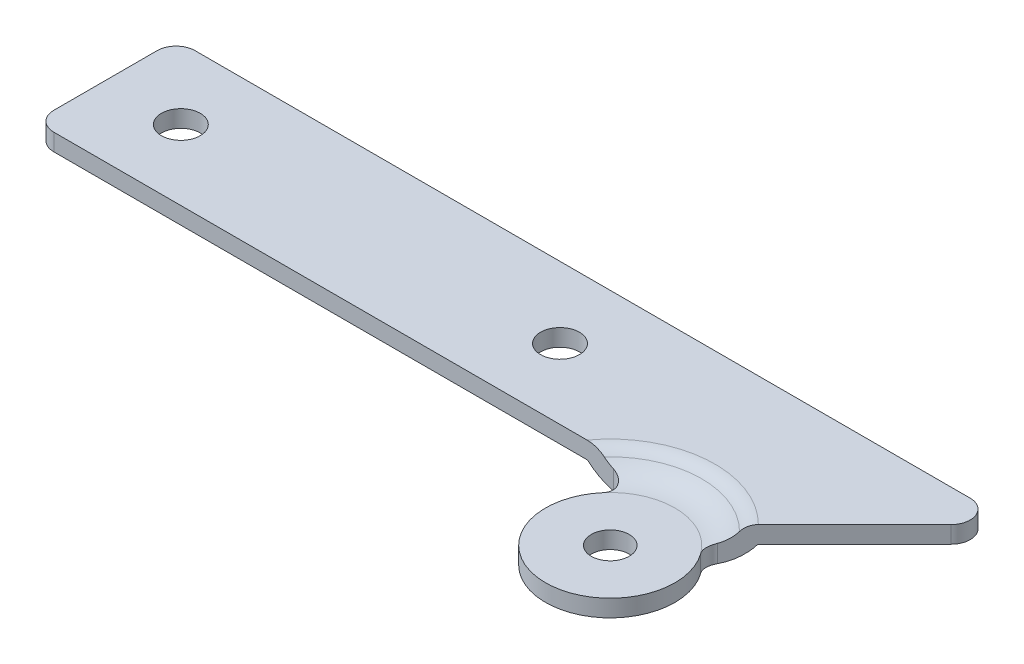
ISO-10303-21;
HEADER;
FILE_DESCRIPTION(('STEP AP214'),'2;1');
FILE_NAME('part.step','',(''),(''),'','','');
FILE_SCHEMA(('AUTOMOTIVE_DESIGN { 1 0 10303 214 1 1 1 1 }'));
ENDSEC;
DATA;
#1=APPLICATION_CONTEXT('core data for automotive mechanical design processes');
#2=APPLICATION_PROTOCOL_DEFINITION('international standard','automotive_design',2000,#1);
#3=PRODUCT_CONTEXT('',#1,'mechanical');
#4=PRODUCT('Part','Part','',(#3));
#5=PRODUCT_RELATED_PRODUCT_CATEGORY('part','',(#4));
#6=PRODUCT_DEFINITION_FORMATION('','',#4);
#7=PRODUCT_DEFINITION_CONTEXT('part definition',#1,'design');
#8=PRODUCT_DEFINITION('design','',#6,#7);
#9=PRODUCT_DEFINITION_SHAPE('','',#8);
#10=(LENGTH_UNIT() NAMED_UNIT(*) SI_UNIT(.MILLI.,.METRE.));
#11=(NAMED_UNIT(*) PLANE_ANGLE_UNIT() SI_UNIT($,.RADIAN.));
#12=(NAMED_UNIT(*) SI_UNIT($,.STERADIAN.) SOLID_ANGLE_UNIT());
#13=UNCERTAINTY_MEASURE_WITH_UNIT(LENGTH_MEASURE(1.E-05),#10,'distance_accuracy_value','');
#14=(GEOMETRIC_REPRESENTATION_CONTEXT(3) GLOBAL_UNCERTAINTY_ASSIGNED_CONTEXT((#13)) GLOBAL_UNIT_ASSIGNED_CONTEXT((#10,
#11,#12)) REPRESENTATION_CONTEXT('',''));
#15=CARTESIAN_POINT('',(0.,0.,0.));
#16=DIRECTION('',(0.,0.,1.));
#17=DIRECTION('',(1.,0.,0.));
#18=AXIS2_PLACEMENT_3D('',#15,#16,#17);
#19=CARTESIAN_POINT('',(44.4503952922486,-3.13962266922809,17.653));
#20=DIRECTION('',(0.,1.,0.));
#21=DIRECTION('',(0.,0.,1.));
#22=AXIS2_PLACEMENT_3D('',#19,#20,#21);
#23=CYLINDRICAL_SURFACE('',#22,2.54);
#24=CARTESIAN_POINT('',(44.4503952922486,-0.12700000003041,17.653));
#25=DIRECTION('',(0.,1.,0.));
#26=DIRECTION('',(0.,0.,1.));
#27=AXIS2_PLACEMENT_3D('',#24,#25,#26);
#28=CIRCLE('',#27,2.54);
#29=CARTESIAN_POINT('',(44.4503952922486,-0.12700000003041,20.193));
#30=VERTEX_POINT('',#29);
#31=EDGE_CURVE('E19',#30,#30,#28,.T.);
#32=ORIENTED_EDGE('',*,*,#31,.T.);
#33=EDGE_LOOP('',(#32));
#34=FACE_BOUND('',#33,.T.);
#35=CARTESIAN_POINT('',(44.4503952922486,-2.41300000003041,17.653));
#36=DIRECTION('',(0.,1.,0.));
#37=DIRECTION('',(0.,0.,1.));
#38=AXIS2_PLACEMENT_3D('',#35,#36,#37);
#39=CIRCLE('',#38,2.54);
#40=CARTESIAN_POINT('',(44.4503952922486,-2.41300000003041,20.193));
#41=VERTEX_POINT('',#40);
#42=EDGE_CURVE('E315',#41,#41,#39,.T.);
#43=ORIENTED_EDGE('',*,*,#42,.F.);
#44=EDGE_LOOP('',(#43));
#45=FACE_BOUND('',#44,.T.);
#46=ADVANCED_FACE('F16',(#34,#45),#23,.F.);
#47=CARTESIAN_POINT('',(44.4503952922486,-0.12700000003041,17.653));
#48=DIRECTION('',(0.,-1.,0.));
#49=DIRECTION('',(0.,0.,-1.));
#50=AXIS2_PLACEMENT_3D('',#47,#48,#49);
#51=PLANE('',#50);
#52=ORIENTED_EDGE('',*,*,#31,.F.);
#53=EDGE_LOOP('',(#52));
#54=FACE_BOUND('',#53,.T.);
#55=CARTESIAN_POINT('',(44.4503952922486,-0.12700000003041,17.653));
#56=DIRECTION('',(0.,-1.,0.));
#57=DIRECTION('',(-0.760302428804956,0.,-0.649569254778337));
#58=AXIS2_PLACEMENT_3D('',#55,#56,#57);
#59=CIRCLE('',#58,8.67699443373867);
#60=CARTESIAN_POINT('',(51.4610548897929,-0.12700000003041,12.54018429723));
#61=VERTEX_POINT('',#60);
#62=CARTESIAN_POINT('',(37.85325534955,-0.12700000003041,12.0166911919606));
#63=VERTEX_POINT('',#62);
#64=EDGE_CURVE('E129',#61,#63,#59,.F.);
#65=ORIENTED_EDGE('',*,*,#64,.T.);
#66=CARTESIAN_POINT('',(44.4503952922486,-0.12700000003041,17.653));
#67=DIRECTION('',(0.,1.,0.));
#68=DIRECTION('',(0.,0.,1.));
#69=AXIS2_PLACEMENT_3D('',#66,#67,#68);
#70=CIRCLE('',#69,8.67699443373867);
#71=EDGE_CURVE('E434',#61,#63,#70,.F.);
#72=ORIENTED_EDGE('',*,*,#71,.F.);
#73=EDGE_LOOP('',(#65,#72));
#74=FACE_BOUND('',#73,.T.);
#75=ADVANCED_FACE('F274',(#54,#74),#51,.F.);
#76=CARTESIAN_POINT('',(44.4503952922486,-2.41300000003041,17.653));
#77=DIRECTION('',(0.,1.,0.));
#78=DIRECTION('',(0.,0.,1.));
#79=AXIS2_PLACEMENT_3D('',#76,#77,#78);
#80=CYLINDRICAL_SURFACE('',#79,8.67699443373867);
#81=DIRECTION('',(0.,1.,0.));
#82=VECTOR('',#81,1.);
#83=CARTESIAN_POINT('',(51.4610548897929,-2.41300000003041,12.54018429723));
#84=LINE('',#83,#82);
#85=CARTESIAN_POINT('',(51.4610548897929,-2.41300000003041,12.54018429723));
#86=VERTEX_POINT('',#85);
#87=EDGE_CURVE('E136',#86,#61,#84,.T.);
#88=ORIENTED_EDGE('',*,*,#87,.T.);
#89=ORIENTED_EDGE('',*,*,#71,.T.);
#90=DIRECTION('',(0.,1.,0.));
#91=VECTOR('',#90,1.);
#92=CARTESIAN_POINT('',(37.85325534955,-2.41300000003041,12.0166911919606));
#93=LINE('',#92,#91);
#94=CARTESIAN_POINT('',(37.85325534955,-2.41300000003041,12.0166911919606));
#95=VERTEX_POINT('',#94);
#96=EDGE_CURVE('E312',#63,#95,#93,.F.);
#97=ORIENTED_EDGE('',*,*,#96,.T.);
#98=CARTESIAN_POINT('',(44.4503952922486,-2.41300000003041,17.653));
#99=DIRECTION('',(0.,1.,0.));
#100=DIRECTION('',(0.,0.,1.));
#101=AXIS2_PLACEMENT_3D('',#98,#99,#100);
#102=CIRCLE('',#101,8.67699443373867);
#103=EDGE_CURVE('E432',#86,#95,#102,.F.);
#104=ORIENTED_EDGE('',*,*,#103,.F.);
#105=EDGE_LOOP('',(#88,#89,#97,#104));
#106=FACE_BOUND('',#105,.T.);
#107=ADVANCED_FACE('F269',(#106),#80,.T.);
#108=CARTESIAN_POINT('',(44.4503952922486,-2.41300000003041,17.653));
#109=DIRECTION('',(0.,-1.,0.));
#110=DIRECTION('',(0.,0.,-1.));
#111=AXIS2_PLACEMENT_3D('',#108,#109,#110);
#112=PLANE('',#111);
#113=ORIENTED_EDGE('',*,*,#42,.T.);
#114=EDGE_LOOP('',(#113));
#115=FACE_BOUND('',#114,.T.);
#116=CARTESIAN_POINT('',(44.4503952922486,-2.41300000003041,17.653));
#117=DIRECTION('',(0.,1.,0.));
#118=DIRECTION('',(0.807959443915839,0.,-0.589238098723435));
#119=AXIS2_PLACEMENT_3D('',#116,#117,#118);
#120=CIRCLE('',#119,8.67699443373866);
#121=EDGE_CURVE('E252',#86,#95,#120,.T.);
#122=ORIENTED_EDGE('',*,*,#121,.F.);
#123=ORIENTED_EDGE('',*,*,#103,.T.);
#124=EDGE_LOOP('',(#122,#123));
#125=FACE_BOUND('',#124,.T.);
#126=ADVANCED_FACE('F258',(#115,#125),#112,.T.);
#127=CARTESIAN_POINT('',(36.6462752438221,-2.41300000003041,10.9855));
#128=DIRECTION('',(0.,1.,0.));
#129=DIRECTION('',(0.,0.,1.));
#130=AXIS2_PLACEMENT_3D('',#127,#128,#129);
#131=CYLINDRICAL_SURFACE('',#130,1.5875);
#132=ORIENTED_EDGE('',*,*,#96,.F.);
#133=CARTESIAN_POINT('',(37.85325534955,-0.12700000003041,12.0166911919606));
#134=CARTESIAN_POINT('',(37.8822032619722,-0.12699357584352,11.9828149944831));
#135=CARTESIAN_POINT('',(37.9097169934397,-0.126999840282788,11.9477161730048));
#136=CARTESIAN_POINT('',(37.9616976655333,-0.126990895706065,11.8753325807003));
#137=CARTESIAN_POINT('',(37.9861647247903,-0.126975687526456,11.8380478950704));
#138=CARTESIAN_POINT('',(38.0318705702176,-0.126876965328563,11.7615581238861));
#139=CARTESIAN_POINT('',(38.0531101087453,-0.12679346725818,11.7223534887115));
#140=CARTESIAN_POINT('',(38.0922153861983,-0.126467953073541,11.6423106593733));
#141=CARTESIAN_POINT('',(38.1100811666746,-0.126225938911719,11.6014724853357));
#142=CARTESIAN_POINT('',(38.1584340754211,-0.125094248648951,11.4768781556044));
#143=CARTESIAN_POINT('',(38.1836898184842,-0.123799017271902,11.3910203137122));
#144=CARTESIAN_POINT('',(38.2194195073506,-0.118970644195672,11.2164140567206));
#145=CARTESIAN_POINT('',(38.2298989666648,-0.11543833793504,11.1276667324337));
#146=CARTESIAN_POINT('',(38.2358406703157,-0.104909760431675,10.9505536318909));
#147=CARTESIAN_POINT('',(38.2314200980152,-0.0979408857131835,10.8621903255012));
#148=CARTESIAN_POINT('',(38.2081038047483,-0.0794855849199816,10.6878781780898));
#149=CARTESIAN_POINT('',(38.1892092882199,-0.067999534777181,10.6019291367839));
#150=CARTESIAN_POINT('',(38.1384394074222,-0.040153215046412,10.4369723447442));
#151=CARTESIAN_POINT('',(38.1068658984526,-0.0239085163032391,10.3578518776138));
#152=CARTESIAN_POINT('',(38.0321417817778,0.0137000461974292,10.2066252996822));
#153=CARTESIAN_POINT('',(37.9889911410483,0.0350639245575904,10.1345192088904));
#154=CARTESIAN_POINT('',(37.8922844507806,0.0828945993898807,9.9982402392753));
#155=CARTESIAN_POINT('',(37.8386137644128,0.10941758782603,9.93416882326385));
#156=CARTESIAN_POINT('',(37.7231010537479,0.16674133326273,9.81612898052181));
#157=CARTESIAN_POINT('',(37.6612569264516,0.197543191306813,9.76216316259424));
#158=CARTESIAN_POINT('',(37.5262537654841,0.26501869039011,9.66133032935777));
#159=CARTESIAN_POINT('',(37.4525914424129,0.301961029216738,9.61531911989643));
#160=CARTESIAN_POINT('',(37.2998739869073,0.37852289602598,9.53623530121435));
#161=CARTESIAN_POINT('',(37.2208149359553,0.418144369103684,9.50317221342322));
#162=CARTESIAN_POINT('',(37.0602108257916,0.498101359430003,9.45061998494698));
#163=CARTESIAN_POINT('',(36.9787180008281,0.538418362156986,9.43094212398631));
#164=CARTESIAN_POINT('',(36.8137075956259,0.618767714248563,9.40465519505122));
#165=CARTESIAN_POINT('',(36.7301940832984,0.658800454737621,9.39802177595316));
#166=CARTESIAN_POINT('',(36.6462752438221,0.697999556154315,9.39799999999998));
#167=B_SPLINE_CURVE_WITH_KNOTS('',3,(#133,#134,#135,#136,#137,#138,#139,#140,#141,#142,#143,
#144,#145,#146,#147,#148,#149,#150,#151,#152,#153,#154,#155,#156,#157,#158,#159,#160,#161,#162,
#163,#164,#165,#166),.UNSPECIFIED.,.F.,.F.,(4,2,2,2,2,2,2,2,2,2,2,2,2,2,2,2,4),(0.,
0.133636146836537,0.267267088533071,0.400866831984319,0.53446492992592,0.801585666559904,
1.06860670538079,1.33353263588604,1.59843652318217,1.85737584270882,2.1163159008791,
2.37825251779267,2.64025666181482,2.92225163565687,3.20445358748349,3.48258934043794,
3.76020537993433),.UNSPECIFIED.);
#168=CARTESIAN_POINT('',(36.6462752438221,0.697999556154314,9.39799999999999));
#169=VERTEX_POINT('',#168);
#170=EDGE_CURVE('E412',#63,#169,#167,.T.);
#171=ORIENTED_EDGE('',*,*,#170,.T.);
#172=DIRECTION('',(0.,1.,0.));
#173=VECTOR('',#172,1.);
#174=CARTESIAN_POINT('',(36.6462752438221,2.286,9.39799999999999));
#175=LINE('',#174,#173);
#176=CARTESIAN_POINT('',(36.6462752438221,-1.88342261208621,9.39799999999999));
#177=VERTEX_POINT('',#176);
#178=EDGE_CURVE('E192',#177,#169,#175,.T.);
#179=ORIENTED_EDGE('',*,*,#178,.F.);
#180=CARTESIAN_POINT('',(37.85325534955,-2.41300000003041,12.0166911919606));
#181=CARTESIAN_POINT('',(37.8822399801254,-2.41299656145982,11.9827650366654));
#182=CARTESIAN_POINT('',(37.9097798997594,-2.41300035391785,11.9476326896234));
#183=CARTESIAN_POINT('',(37.96180592947,-2.41299335372206,11.87517769664));
#184=CARTESIAN_POINT('',(37.9862921732067,-2.41298256170685,11.8378551466695));
#185=CARTESIAN_POINT('',(38.0548639607022,-2.41288483491481,11.7230369835564));
#186=CARTESIAN_POINT('',(38.0941438961141,-2.41273270090005,11.6425954690924));
#187=CARTESIAN_POINT('',(38.1586507183666,-2.41170395339247,11.4762632866642));
#188=CARTESIAN_POINT('',(38.183870193205,-2.41082695839116,11.3903697711881));
#189=CARTESIAN_POINT('',(38.2195374965038,-2.40755355376761,11.2156046156913));
#190=CARTESIAN_POINT('',(38.2299893395239,-2.40515755734045,11.1267337917753));
#191=CARTESIAN_POINT('',(38.2358361307235,-2.39800351885394,10.9489131377669));
#192=CARTESIAN_POINT('',(38.231285291383,-2.39325403393996,10.8599647507378));
#193=CARTESIAN_POINT('',(38.2074540726679,-2.38065918723953,10.6842794011772));
#194=CARTESIAN_POINT('',(38.1881732038192,-2.37281372257888,10.597542512232));
#195=CARTESIAN_POINT('',(38.1358828502528,-2.3536477433091,10.4297415081447));
#196=CARTESIAN_POINT('',(38.103020787721,-2.34236487683622,10.3486270799451));
#197=CARTESIAN_POINT('',(38.0247563161692,-2.31615995088939,10.1933470159968));
#198=CARTESIAN_POINT('',(37.97935429845,-2.30123800497215,10.119181163519));
#199=CARTESIAN_POINT('',(37.8772356197002,-2.26785424035333,9.97929991995353));
#200=CARTESIAN_POINT('',(37.8204520258506,-2.24937150758591,9.91363849131462));
#201=CARTESIAN_POINT('',(37.6975248365339,-2.20942785197899,9.7928301107711));
#202=CARTESIAN_POINT('',(37.6313793175245,-2.18796631711929,9.73768532514178));
#203=CARTESIAN_POINT('',(37.4889757435167,-2.14195097181251,9.63720877673361));
#204=CARTESIAN_POINT('',(37.4124314802008,-2.11731137977342,9.59232256416344));
#205=CARTESIAN_POINT('',(37.2533390009948,-2.06661146026913,9.51600528390614));
#206=CARTESIAN_POINT('',(37.1707903710161,-2.04055103484788,9.48457514524246));
#207=CARTESIAN_POINT('',(37.0149126795996,-1.99222809275234,9.43960843656497));
#208=CARTESIAN_POINT('',(36.9421471130521,-1.97000543455366,9.4240488670552));
#209=CARTESIAN_POINT('',(36.795083077898,-1.92611915795541,9.40324552473372));
#210=CARTESIAN_POINT('',(36.7207864028513,-1.90445494568515,9.39799030609377));
#211=CARTESIAN_POINT('',(36.6462752438221,-1.88342261208621,9.39799999999998));
#212=B_SPLINE_CURVE_WITH_KNOTS('',3,(#180,#181,#182,#183,#184,#185,#186,#187,#188,#189,#190,
#191,#192,#193,#194,#195,#196,#197,#198,#199,#200,#201,#202,#203,#204,#205,#206,#207,#208,#209,
#210,#211),.UNSPECIFIED.,.F.,.F.,(4,2,2,2,2,2,2,2,2,2,2,2,2,2,2,4),(0.,0.133782854775079,
0.267559851789285,0.534742553649619,0.802065968599256,1.06931669806774,1.3356027719386,
1.6018976947931,1.86537493105363,2.1288439466127,2.39391040206322,2.65903139850863,
2.93409470785859,3.20917700484736,3.44146576522841,3.67349635827377),.UNSPECIFIED.);
#213=EDGE_CURVE('E393',#95,#177,#212,.T.);
#214=ORIENTED_EDGE('',*,*,#213,.F.);
#215=EDGE_LOOP('',(#132,#171,#179,#214));
#216=FACE_BOUND('',#215,.T.);
#217=ADVANCED_FACE('F268',(#216),#131,.F.);
#218=CARTESIAN_POINT('',(44.4503952922486,4.64819999996959,17.653));
#219=DIRECTION('',(0.,1.,0.));
#220=DIRECTION('',(0.,0.,1.));
#221=AXIS2_PLACEMENT_3D('',#218,#219,#220);
#222=TOROIDAL_SURFACE('',#221,8.67699443373867,4.7752);
#223=CARTESIAN_POINT('',(44.4503952922486,1.48166666663626,17.653));
#224=DIRECTION('',(0.,1.,0.));
#225=DIRECTION('',(0.,0.,1.));
#226=AXIS2_PLACEMENT_3D('',#223,#224,#225);
#227=CIRCLE('',#226,12.2512918036967);
#228=CARTESIAN_POINT('',(35.3978196444384,1.48166666663626,9.39799999999999));
#229=VERTEX_POINT('',#228);
#230=CARTESIAN_POINT('',(53.1133668049377,1.48166666663626,8.99002848731088));
#231=VERTEX_POINT('',#230);
#232=EDGE_CURVE('E214',#229,#231,#227,.F.);
#233=ORIENTED_EDGE('',*,*,#232,.F.);
#234=CARTESIAN_POINT('',(36.6462752438221,0.697999556154315,9.39799999999998));
#235=CARTESIAN_POINT('',(36.5902691154025,0.724131846142782,9.39799999999999));
#236=CARTESIAN_POINT('',(36.5346331071177,0.75106198866906,9.39799999999999));
#237=CARTESIAN_POINT('',(36.4243419247119,0.806465591426125,9.39799999999999));
#238=CARTESIAN_POINT('',(36.3696843301863,0.834934235464384,9.39799999999999));
#239=CARTESIAN_POINT('',(36.2613709557785,0.893455789059646,9.39799999999999));
#240=CARTESIAN_POINT('',(36.2077133161656,0.92350525281748,9.39799999999999));
#241=CARTESIAN_POINT('',(36.1014240037671,0.985232372130987,9.39799999999999));
#242=CARTESIAN_POINT('',(36.0487912313239,1.01690813289203,9.39799999999999));
#243=CARTESIAN_POINT('',(35.9445605804883,1.08194764649301,9.39799999999999));
#244=CARTESIAN_POINT('',(35.8929629565739,1.1153118074722,9.39799999999999));
#245=CARTESIAN_POINT('',(35.7908560301176,1.18376895949815,9.39799999999999));
#246=CARTESIAN_POINT('',(35.7403478043849,1.21886355767911,9.39799999999999));
#247=CARTESIAN_POINT('',(35.640459396077,1.29083747221312,9.39799999999999));
#248=CARTESIAN_POINT('',(35.5910817612592,1.32772032800084,9.39799999999999));
#249=CARTESIAN_POINT('',(35.4934995257495,1.40333131706467,9.39799999999999));
#250=CARTESIAN_POINT('',(35.4452993329232,1.44206513717306,9.39799999999999));
#251=CARTESIAN_POINT('',(35.3978196444384,1.48166666663626,9.39799999999999));
#252=B_SPLINE_CURVE_WITH_KNOTS('',3,(#234,#235,#236,#237,#238,#239,#240,#241,#242,#243,#244,
#245,#246,#247,#248,#249,#250,#251),.UNSPECIFIED.,.F.,.F.,(4,2,2,2,2,2,2,2,4),(0.,
0.185404947511082,0.370259787606954,0.554727160050264,0.738984282775716,0.923286160990438,
1.10776255686209,1.29262030634037,1.47808797916946),.UNSPECIFIED.);
#253=EDGE_CURVE('E195',#169,#229,#252,.T.);
#254=ORIENTED_EDGE('',*,*,#253,.F.);
#255=ORIENTED_EDGE('',*,*,#170,.F.);
#256=ORIENTED_EDGE('',*,*,#64,.F.);
#257=CARTESIAN_POINT('',(51.4610548897929,-0.12700000003041,12.54018429723));
#258=CARTESIAN_POINT('',(51.4347952435241,-0.126993576169972,12.5041844237733));
#259=CARTESIAN_POINT('',(51.4100594557561,-0.126999840389627,12.4670757328376));
#260=CARTESIAN_POINT('',(51.3637935731327,-0.126990895771473,12.3909129511888));
#261=CARTESIAN_POINT('',(51.3422633536243,-0.126975687768884,12.3518589362012));
#262=CARTESIAN_POINT('',(51.3025689666508,-0.126876967346128,12.2720838432183));
#263=CARTESIAN_POINT('',(51.2844040455595,-0.126793470241382,12.2313631409614));
#264=CARTESIAN_POINT('',(51.2515635702301,-0.12646795458767,12.148552186645));
#265=CARTESIAN_POINT('',(51.236887972795,-0.126225938001275,12.1064619515473));
#266=CARTESIAN_POINT('',(51.1982494269307,-0.125094236049684,11.9785188763009));
#267=CARTESIAN_POINT('',(51.179664163295,-0.123798984730494,11.890972393628));
#268=CARTESIAN_POINT('',(51.1574552766642,-0.118970447290142,11.7141369859358));
#269=CARTESIAN_POINT('',(51.1538253635298,-0.115438102799588,11.6248488093434));
#270=CARTESIAN_POINT('',(51.1615071822012,-0.104910519918037,11.4478162466703));
#271=CARTESIAN_POINT('',(51.1727004199007,-0.0979430199973769,11.3600652312143));
#272=CARTESIAN_POINT('',(51.2093376710495,-0.079488046182522,11.1880570011627));
#273=CARTESIAN_POINT('',(51.2347840348522,-0.067999826910597,11.1038003652552));
#274=CARTESIAN_POINT('',(51.2980937114425,-0.0401463988706432,10.9431802392321));
#275=CARTESIAN_POINT('',(51.3356708284695,-0.0238943252310592,10.8666836617983));
#276=CARTESIAN_POINT('',(51.4218273784822,0.0137310345407412,10.7216306995218));
#277=CARTESIAN_POINT('',(51.4703936250435,0.0350981845956175,10.6530649458814));
#278=CARTESIAN_POINT('',(51.5390102706255,0.0658000581678463,10.5706039560829));
#279=CARTESIAN_POINT('',(51.5549481803034,0.0729625340841673,10.5523264539436));
#280=CARTESIAN_POINT('',(51.5875287303717,0.0876713433967778,10.5166388806914));
#281=CARTESIAN_POINT('',(51.6041700151685,0.0952169435970285,10.4992272702198));
#282=CARTESIAN_POINT('',(51.6211584918745,0.102955193081931,10.482236800372));
#283=B_SPLINE_CURVE_WITH_KNOTS('',3,(#257,#258,#259,#260,#261,#262,#263,#264,#265,#266,#267,
#268,#269,#270,#271,#272,#273,#274,#275,#276,#277,#278,#279,#280,#281,#282),.UNSPECIFIED.,.F.,
.F.,(4,2,2,2,2,2,2,2,2,2,2,2,4),(0.,0.133635525210901,0.267265852455416,0.400866218203313,
0.534464929925057,0.801591999641598,1.06860670568735,1.33349976697926,1.5984365222408,
1.85753083598403,2.11631588249819,2.19215663343425,2.26785734769636),.UNSPECIFIED.);
#284=CARTESIAN_POINT('',(51.6211584918751,0.102955193081953,10.4822368003724));
#285=VERTEX_POINT('',#284);
#286=EDGE_CURVE('E125',#61,#285,#283,.T.);
#287=ORIENTED_EDGE('',*,*,#286,.T.);
#288=CARTESIAN_POINT('',(53.1133668049377,1.48166666663626,8.99002848731088));
#289=CARTESIAN_POINT('',(53.0497322459138,1.38006256996459,9.05366304633481));
#290=CARTESIAN_POINT('',(52.983019935166,1.28231635857511,9.12037535708255));
#291=CARTESIAN_POINT('',(52.8439397243861,1.09517938502789,9.25945556786241));
#292=CARTESIAN_POINT('',(52.7715703784005,1.00579077200134,9.33182491384807));
#293=CARTESIAN_POINT('',(52.623353614427,0.837923915497622,9.4800416778216));
#294=CARTESIAN_POINT('',(52.5476173819415,0.759249284267575,9.55577791030706));
#295=CARTESIAN_POINT('',(52.3918064495921,0.611125458109484,9.71158884265645));
#296=CARTESIAN_POINT('',(52.3117333955879,0.541672797430706,9.79166189666064));
#297=CARTESIAN_POINT('',(52.1336200102782,0.40129417684349,9.96977528197036));
#298=CARTESIAN_POINT('',(52.0348626495808,0.332179913405813,10.0685326426677));
#299=CARTESIAN_POINT('',(51.8317276911468,0.207075407463629,10.2716676011018));
#300=CARTESIAN_POINT('',(51.7272932743001,0.151269649615786,10.3761020179485));
#301=CARTESIAN_POINT('',(51.6211584918757,0.102955193081979,10.4822368003729));
#302=B_SPLINE_CURVE_WITH_KNOTS('',3,(#288,#289,#290,#291,#292,#293,#294,#295,#296,#297,#298,
#299,#300,#301),.UNSPECIFIED.,.F.,.F.,(4,2,2,2,2,2,4),(0.,0.407058804524099,0.814221996750503,
1.21244954215881,1.61052700169594,2.07725848029542,2.55012599001393),.UNSPECIFIED.);
#303=EDGE_CURVE('E112',#231,#285,#302,.T.);
#304=ORIENTED_EDGE('',*,*,#303,.F.);
#305=EDGE_LOOP('',(#233,#254,#255,#256,#287,#304));
#306=FACE_BOUND('',#305,.T.);
#307=ADVANCED_FACE('F126',(#306),#222,.F.);
#308=CARTESIAN_POINT('',(52.7436905070093,-2.41300000003041,11.6047688155066));
#309=DIRECTION('',(0.,1.,0.));
#310=DIRECTION('',(0.,0.,1.));
#311=AXIS2_PLACEMENT_3D('',#308,#309,#310);
#312=CYLINDRICAL_SURFACE('',#311,1.5875);
#313=DIRECTION('',(0.,1.,0.));
#314=VECTOR('',#313,1.);
#315=CARTESIAN_POINT('',(51.6211584918757,2.286,10.4822368003729));
#316=LINE('',#315,#314);
#317=CARTESIAN_POINT('',(51.6211584918757,-2.2595681457153,10.4822368003729));
#318=VERTEX_POINT('',#317);
#319=EDGE_CURVE('E116',#285,#318,#316,.F.);
#320=ORIENTED_EDGE('',*,*,#319,.F.);
#321=ORIENTED_EDGE('',*,*,#286,.F.);
#322=ORIENTED_EDGE('',*,*,#87,.F.);
#323=CARTESIAN_POINT('',(51.6211584918757,-2.2595681457153,10.4822368003729));
#324=CARTESIAN_POINT('',(51.590473619888,-2.26876697908094,10.5129219730938));
#325=CARTESIAN_POINT('',(51.5609983477627,-2.27754895503426,10.5449152356508));
#326=CARTESIAN_POINT('',(51.5046702811015,-2.29424437852611,10.6113483941292));
#327=CARTESIAN_POINT('',(51.4778177321217,-2.30215774474841,10.645788518621));
#328=CARTESIAN_POINT('',(51.4015779054809,-2.32451956228859,10.7524172687029));
#329=CARTESIAN_POINT('',(51.3564223107895,-2.33761541005459,10.8280002430247));
#330=CARTESIAN_POINT('',(51.2790519676684,-2.36014179061674,10.9860973119358));
#331=CARTESIAN_POINT('',(51.2468526373931,-2.36956795600374,11.0686195240354));
#332=CARTESIAN_POINT('',(51.1965846773915,-2.3850724631475,11.2381270113683));
#333=CARTESIAN_POINT('',(51.1785091938078,-2.39115242828565,11.3251101000135));
#334=CARTESIAN_POINT('',(51.1572185821755,-2.40055201739991,11.5001000445791));
#335=CARTESIAN_POINT('',(51.153852626479,-2.40389937032047,11.5880871891045));
#336=CARTESIAN_POINT('',(51.1617084664939,-2.40872871924282,11.7635186965492));
#337=CARTESIAN_POINT('',(51.1729400383739,-2.41020946384211,11.8509626562682));
#338=CARTESIAN_POINT('',(51.2098634905342,-2.41211759678412,12.0235745277887));
#339=CARTESIAN_POINT('',(51.235686899425,-2.41253521103583,12.1087142499874));
#340=CARTESIAN_POINT('',(51.3011535082902,-2.41297114569377,12.2733996922009));
#341=CARTESIAN_POINT('',(51.3407716375562,-2.41299018666137,12.3529552479044));
#342=CARTESIAN_POINT('',(51.3982751203639,-2.41299849800293,12.4476911652213));
#343=CARTESIAN_POINT('',(51.4102926338021,-2.41299938180028,12.4665744242925));
#344=CARTESIAN_POINT('',(51.4350975658723,-2.41300022059359,12.5037895874197));
#345=CARTESIAN_POINT('',(51.4478838659454,-2.41300017690788,12.5221222369806));
#346=CARTESIAN_POINT('',(51.4610548897927,-2.41300000003041,12.5401842972301));
#347=B_SPLINE_CURVE_WITH_KNOTS('',3,(#323,#324,#325,#326,#327,#328,#329,#330,#331,#332,#333,
#334,#335,#336,#337,#338,#339,#340,#341,#342,#343,#344,#345,#346),.UNSPECIFIED.,.F.,.F.,(4,2,2,
2,2,2,2,2,2,2,2,4),(0.,0.133002458630632,0.26601735789049,0.531678698952267,0.797655252717396,
1.06350265615487,1.32661763670419,1.5899089198722,1.85561222044711,2.12083512729617,
2.18797227958885,2.25501400848879),.UNSPECIFIED.);
#348=EDGE_CURVE('E135',#318,#86,#347,.T.);
#349=ORIENTED_EDGE('',*,*,#348,.F.);
#350=EDGE_LOOP('',(#320,#321,#322,#349));
#351=FACE_BOUND('',#350,.T.);
#352=ADVANCED_FACE('F138',(#351),#312,.F.);
#353=CARTESIAN_POINT('',(44.4503952922486,4.64819999996959,17.653));
#354=DIRECTION('',(0.,1.,0.));
#355=DIRECTION('',(0.,0.,1.));
#356=AXIS2_PLACEMENT_3D('',#353,#354,#355);
#357=TOROIDAL_SURFACE('',#356,8.67699443373867,7.0612);
#358=ORIENTED_EDGE('',*,*,#213,.T.);
#359=CARTESIAN_POINT('',(33.1896957390191,-0.0342269503850164,9.398));
#360=CARTESIAN_POINT('',(33.309184548041,-0.143019797463722,9.39799999999999));
#361=CARTESIAN_POINT('',(33.4323359881504,-0.247746106593866,9.39799999999999));
#362=CARTESIAN_POINT('',(33.6850299171103,-0.448839717821115,9.39799999999999));
#363=CARTESIAN_POINT('',(33.8145639502821,-0.545217636345454,9.39799999999999));
#364=CARTESIAN_POINT('',(34.0793623331157,-0.729642735477888,9.39799999999999));
#365=CARTESIAN_POINT('',(34.2146249833065,-0.817692362067445,9.39799999999999));
#366=CARTESIAN_POINT('',(34.4877291969917,-0.984025218323826,9.39799999999999));
#367=CARTESIAN_POINT('',(34.6254821375913,-1.06245426802723,9.39799999999999));
#368=CARTESIAN_POINT('',(34.9052000583578,-1.21144169194825,9.39799999999999));
#369=CARTESIAN_POINT('',(35.0471657040402,-1.28199881410246,9.39799999999999));
#370=CARTESIAN_POINT('',(35.3346214859613,-1.4153843694714,9.39799999999999));
#371=CARTESIAN_POINT('',(35.4801105492538,-1.47821512095203,9.39799999999999));
#372=CARTESIAN_POINT('',(35.7930413014898,-1.60403701838155,9.39799999999999));
#373=CARTESIAN_POINT('',(35.9608940437835,-1.66600354427327,9.39799999999999));
#374=CARTESIAN_POINT('',(36.3008479467168,-1.78128114646283,9.39799999999999));
#375=CARTESIAN_POINT('',(36.472970464693,-1.83452937873956,9.39799999999999));
#376=CARTESIAN_POINT('',(36.6462752438221,-1.8834226120862,9.39799999999999));
#377=B_SPLINE_CURVE_WITH_KNOTS('',3,(#359,#360,#361,#362,#363,#364,#365,#366,#367,#368,#369,
#370,#371,#372,#373,#374,#375,#376),.UNSPECIFIED.,.F.,.F.,(4,2,2,2,2,2,2,2,4),(0.,
0.484654534646943,0.968683410578138,1.45256968513056,1.92785184280186,2.40320948866393,
2.87842415558414,3.41493394637438,3.95515531087969),.UNSPECIFIED.);
#378=CARTESIAN_POINT('',(33.1896957390191,-0.0342269503850147,9.39799999999999));
#379=VERTEX_POINT('',#378);
#380=EDGE_CURVE('E196',#379,#177,#377,.T.);
#381=ORIENTED_EDGE('',*,*,#380,.F.);
#382=CARTESIAN_POINT('',(44.4503952922486,-0.0342269503850148,17.653));
#383=DIRECTION('',(0.,1.,0.));
#384=DIRECTION('',(0.,0.,1.));
#385=AXIS2_PLACEMENT_3D('',#382,#383,#384);
#386=CIRCLE('',#385,13.9623916084638);
#387=CARTESIAN_POINT('',(54.3232970801755,-0.0342269503850164,7.78009821207306));
#388=VERTEX_POINT('',#387);
#389=EDGE_CURVE('E122',#379,#388,#386,.F.);
#390=ORIENTED_EDGE('',*,*,#389,.T.);
#391=CARTESIAN_POINT('',(51.6211584918757,-2.2595681457153,10.4822368003729));
#392=CARTESIAN_POINT('',(51.7603045683477,-2.21788674236586,10.3430907239009));
#393=CARTESIAN_POINT('',(51.8981838577658,-2.16775303561884,10.2052114344828));
#394=CARTESIAN_POINT('',(52.1704197812672,-2.05104424876379,9.9329755109814));
#395=CARTESIAN_POINT('',(52.3047763870229,-1.9844690364869,9.79861890522568));
#396=CARTESIAN_POINT('',(52.5655308538123,-1.83728554838523,9.53786443843621));
#397=CARTESIAN_POINT('',(52.6920448910463,-1.75708848162003,9.41135040120231));
#398=CARTESIAN_POINT('',(52.9399093043177,-1.58210651779362,9.16348598793087));
#399=CARTESIAN_POINT('',(53.0612603380869,-1.48732348603135,9.04213495416165));
#400=CARTESIAN_POINT('',(53.284879545404,-1.29507683956904,8.81851574684457));
#401=CARTESIAN_POINT('',(53.3877745398704,-1.19906708567755,8.71562075237821));
#402=CARTESIAN_POINT('',(53.5882639786792,-0.996549887399507,8.51513131356939));
#403=CARTESIAN_POINT('',(53.6858584926346,-0.89004258093248,8.41753679961399));
#404=CARTESIAN_POINT('',(53.8774625710033,-0.664457128941352,8.22593272124522));
#405=CARTESIAN_POINT('',(53.9713316036532,-0.545140192599588,8.13206368859531));
#406=CARTESIAN_POINT('',(54.1524306431355,-0.296792408721661,7.95096464911301));
#407=CARTESIAN_POINT('',(54.2396598260079,-0.167760359545339,7.86373546624067));
#408=CARTESIAN_POINT('',(54.3232970801755,-0.0342269503850207,7.78009821207306));
#409=B_SPLINE_CURVE_WITH_KNOTS('',3,(#391,#392,#393,#394,#395,#396,#397,#398,#399,#400,#401,
#402,#403,#404,#405,#406,#407,#408),.UNSPECIFIED.,.F.,.F.,(4,2,2,2,2,2,2,2,4),(0.,
0.603261737167172,1.20652832395202,1.79406362940766,2.38152386134998,2.90406148649677,
3.42659224732593,3.96155470220782,4.4965834344205),.UNSPECIFIED.);
#410=EDGE_CURVE('E141',#318,#388,#409,.T.);
#411=ORIENTED_EDGE('',*,*,#410,.F.);
#412=ORIENTED_EDGE('',*,*,#348,.T.);
#413=ORIENTED_EDGE('',*,*,#121,.T.);
#414=EDGE_LOOP('',(#358,#381,#390,#411,#412,#413));
#415=FACE_BOUND('',#414,.T.);
#416=ADVANCED_FACE('F401',(#415),#357,.T.);
#417=CARTESIAN_POINT('',(44.4503952922486,2.286,17.653));
#418=DIRECTION('',(0.,1.,0.));
#419=DIRECTION('',(0.,0.,1.));
#420=AXIS2_PLACEMENT_3D('',#417,#418,#419);
#421=PLANE('',#420);
#422=CARTESIAN_POINT('',(-30.734,2.286,0.));
#423=DIRECTION('',(0.,1.,0.));
#424=DIRECTION('',(0.,0.,1.));
#425=AXIS2_PLACEMENT_3D('',#422,#423,#424);
#426=CIRCLE('',#425,2.6035);
#427=CARTESIAN_POINT('',(-30.734,2.286,2.6035));
#428=VERTEX_POINT('',#427);
#429=EDGE_CURVE('E386',#428,#428,#426,.F.);
#430=ORIENTED_EDGE('',*,*,#429,.T.);
#431=EDGE_LOOP('',(#430));
#432=FACE_BOUND('',#431,.T.);
#433=CARTESIAN_POINT('',(20.066,2.286,0.));
#434=DIRECTION('',(0.,1.,0.));
#435=DIRECTION('',(0.,0.,1.));
#436=AXIS2_PLACEMENT_3D('',#433,#434,#435);
#437=CIRCLE('',#436,2.6035);
#438=CARTESIAN_POINT('',(20.066,2.286,2.6035));
#439=VERTEX_POINT('',#438);
#440=EDGE_CURVE('E384',#439,#439,#437,.F.);
#441=ORIENTED_EDGE('',*,*,#440,.T.);
#442=EDGE_LOOP('',(#441));
#443=FACE_BOUND('',#442,.T.);
#444=CARTESIAN_POINT('',(-38.3536047077515,2.286,6.858));
#445=DIRECTION('',(0.,1.,0.));
#446=DIRECTION('',(0.,0.,1.));
#447=AXIS2_PLACEMENT_3D('',#444,#445,#446);
#448=CIRCLE('',#447,2.54);
#449=CARTESIAN_POINT('',(-38.3536047077515,2.286,9.398));
#450=VERTEX_POINT('',#449);
#451=CARTESIAN_POINT('',(-40.8936047077515,2.286,6.858));
#452=VERTEX_POINT('',#451);
#453=EDGE_CURVE('E201',#450,#452,#448,.F.);
#454=ORIENTED_EDGE('',*,*,#453,.F.);
#455=DIRECTION('',(1.,0.,0.));
#456=VECTOR('',#455,1.);
#457=CARTESIAN_POINT('',(41.1508385038299,2.286,9.39799999999999));
#458=LINE('',#457,#456);
#459=CARTESIAN_POINT('',(33.0955379019469,2.28599999998784,9.39799999999999));
#460=VERTEX_POINT('',#459);
#461=EDGE_CURVE('E181',#460,#450,#458,.F.);
#462=ORIENTED_EDGE('',*,*,#461,.F.);
#463=CARTESIAN_POINT('',(44.4503952922486,2.28599999996959,17.653));
#464=DIRECTION('',(0.,1.,0.));
#465=DIRECTION('',(0.707106781186546,0.,-0.707106781186549));
#466=AXIS2_PLACEMENT_3D('',#463,#464,#465);
#467=CIRCLE('',#466,14.0384404886757);
#468=CARTESIAN_POINT('',(54.377071759075,2.28599999998784,7.7263235331736));
#469=VERTEX_POINT('',#468);
#470=EDGE_CURVE('E387',#469,#460,#467,.T.);
#471=ORIENTED_EDGE('',*,*,#470,.F.);
#472=DIRECTION('',(0.707106781186546,0.,-0.707106781186549));
#473=VECTOR('',#472,1.);
#474=CARTESIAN_POINT('',(50.736574576997,2.286,11.3668207152516));
#475=LINE('',#474,#473);
#476=CARTESIAN_POINT('',(67.2923440680347,2.286,-5.18894877578618));
#477=VERTEX_POINT('',#476);
#478=EDGE_CURVE('E151',#477,#469,#475,.F.);
#479=ORIENTED_EDGE('',*,*,#478,.F.);
#480=CARTESIAN_POINT('',(65.4962928438208,2.286,-6.985));
#481=DIRECTION('',(0.,1.,0.));
#482=DIRECTION('',(0.,0.,1.));
#483=AXIS2_PLACEMENT_3D('',#480,#481,#482);
#484=CIRCLE('',#483,2.54);
#485=CARTESIAN_POINT('',(65.4962928438208,2.286,-9.525));
#486=VERTEX_POINT('',#485);
#487=EDGE_CURVE('E211',#486,#477,#484,.F.);
#488=ORIENTED_EDGE('',*,*,#487,.F.);
#489=DIRECTION('',(-1.,0.,0.));
#490=VECTOR('',#489,1.);
#491=CARTESIAN_POINT('',(-40.8936047077515,2.286,-9.525));
#492=LINE('',#491,#490);
#493=CARTESIAN_POINT('',(-38.3536047077515,2.286,-9.525));
#494=VERTEX_POINT('',#493);
#495=EDGE_CURVE('E208',#494,#486,#492,.F.);
#496=ORIENTED_EDGE('',*,*,#495,.F.);
#497=CARTESIAN_POINT('',(-38.3536047077515,2.286,-6.985));
#498=DIRECTION('',(0.,1.,0.));
#499=DIRECTION('',(0.,0.,1.));
#500=AXIS2_PLACEMENT_3D('',#497,#498,#499);
#501=CIRCLE('',#500,2.54);
#502=CARTESIAN_POINT('',(-40.8936047077515,2.286,-6.985));
#503=VERTEX_POINT('',#502);
#504=EDGE_CURVE('E205',#503,#494,#501,.F.);
#505=ORIENTED_EDGE('',*,*,#504,.F.);
#506=DIRECTION('',(0.,0.,1.));
#507=VECTOR('',#506,1.);
#508=CARTESIAN_POINT('',(-40.8936047077515,2.286,9.398));
#509=LINE('',#508,#507);
#510=EDGE_CURVE('E202',#452,#503,#509,.F.);
#511=ORIENTED_EDGE('',*,*,#510,.F.);
#512=EDGE_LOOP('',(#454,#462,#471,#479,#488,#496,#505,#511));
#513=FACE_BOUND('',#512,.T.);
#514=ADVANCED_FACE('F223',(#432,#443,#513),#421,.T.);
#515=CARTESIAN_POINT('',(44.4503952922486,-0.10160000003041,17.653));
#516=DIRECTION('',(0.,1.,0.));
#517=DIRECTION('',(0.,0.,1.));
#518=AXIS2_PLACEMENT_3D('',#515,#516,#517);
#519=TOROIDAL_SURFACE('',#518,14.0384404886757,2.3876);
#520=ORIENTED_EDGE('',*,*,#470,.T.);
#521=CARTESIAN_POINT('',(35.3978196444384,1.48166666663626,9.39799999999999));
#522=CARTESIAN_POINT('',(35.318459490364,1.54781254818349,9.39799999999999));
#523=CARTESIAN_POINT('',(35.2357608541375,1.60982719854078,9.39799999999999));
#524=CARTESIAN_POINT('',(35.0649164532028,1.72561433893596,9.39799999999999));
#525=CARTESIAN_POINT('',(34.9767774672605,1.77939680668766,9.39799999999999));
#526=CARTESIAN_POINT('',(34.7985543490562,1.87754002429786,9.39799999999999));
#527=CARTESIAN_POINT('',(34.7085893895245,1.92211826885084,9.39799999999999));
#528=CARTESIAN_POINT('',(34.5252847288344,2.00368333567142,9.39799999999999));
#529=CARTESIAN_POINT('',(34.4319438150998,2.04066739776254,9.39799999999998));
#530=CARTESIAN_POINT('',(34.1411229712526,2.14255539578408,9.39799999999998));
#531=CARTESIAN_POINT('',(33.9390615954929,2.19500056907658,9.39799999999999));
#532=CARTESIAN_POINT('',(33.6288845458628,2.24889657113773,9.39799999999999));
#533=CARTESIAN_POINT('',(33.5227257818189,2.26274322949401,9.39799999999999));
#534=CARTESIAN_POINT('',(33.3095865893164,2.28128732758038,9.39799999999999));
#535=CARTESIAN_POINT('',(33.202605955869,2.28598240510563,9.39799999999999));
#536=CARTESIAN_POINT('',(33.0955379019469,2.28599999996959,9.39799999999999));
#537=B_SPLINE_CURVE_WITH_KNOTS('',3,(#521,#522,#523,#524,#525,#526,#527,#528,#529,#530,#531,
#532,#533,#534,#535,#536),.UNSPECIFIED.,.F.,.F.,(4,2,2,2,2,2,2,4),(0.,0.309680460000033,
0.618982551743188,0.91982326427694,1.22077312738179,1.84368043914905,2.16453455196528,
2.48547147264133),.UNSPECIFIED.);
#538=EDGE_CURVE('E189',#229,#460,#537,.T.);
#539=ORIENTED_EDGE('',*,*,#538,.F.);
#540=ORIENTED_EDGE('',*,*,#232,.T.);
#541=CARTESIAN_POINT('',(54.377071759075,2.28599999996959,7.7263235331736));
#542=CARTESIAN_POINT('',(54.3296044364467,2.28600651262537,7.77379085580185));
#543=CARTESIAN_POINT('',(54.2821391848628,2.2831689999296,7.82125610738573));
#544=CARTESIAN_POINT('',(54.1875468070952,2.27185576056228,7.91584848515334));
#545=CARTESIAN_POINT('',(54.1404196734232,2.26338015915022,7.9629756188254));
#546=CARTESIAN_POINT('',(54.046835545991,2.24084061585375,8.05655974625754));
#547=CARTESIAN_POINT('',(54.0003785497991,2.22677669425396,8.10301674244947));
#548=CARTESIAN_POINT('',(53.9084796949122,2.19317381725238,8.19491559733638));
#549=CARTESIAN_POINT('',(53.8630377965392,2.17363507625558,8.2403574957094));
#550=CARTESIAN_POINT('',(53.7286553238736,2.10696115624211,8.37473996837495));
#551=CARTESIAN_POINT('',(53.6416430721546,2.05176467092183,8.461752220094));
#552=CARTESIAN_POINT('',(53.4755434039454,1.92155042580137,8.62785188830315));
#553=CARTESIAN_POINT('',(53.3964451368599,1.84656033251368,8.70695015538868));
#554=CARTESIAN_POINT('',(53.2847844714534,1.72024153702156,8.81861082079515));
#555=CARTESIAN_POINT('',(53.2484664620983,1.67541292772542,8.85492883015029));
#556=CARTESIAN_POINT('',(53.1787143665815,1.58159289498428,8.92468092566705));
#557=CARTESIAN_POINT('',(53.1452766797145,1.53260682556238,8.95811861253401));
#558=CARTESIAN_POINT('',(53.1133668049377,1.48166666663626,8.99002848731088));
#559=B_SPLINE_CURVE_WITH_KNOTS('',3,(#541,#542,#543,#544,#545,#546,#547,#548,#549,#550,#551,
#552,#553,#554,#555,#556,#557,#558),.UNSPECIFIED.,.F.,.F.,(4,2,2,2,2,2,2,2,4),(0.,
0.20132158788926,0.402638703234362,0.60395508784018,0.805263589591327,1.20781727411282,
1.6098112418259,1.81411165236281,2.01815284286006),.UNSPECIFIED.);
#560=EDGE_CURVE('E119',#469,#231,#559,.T.);
#561=ORIENTED_EDGE('',*,*,#560,.F.);
#562=EDGE_LOOP('',(#520,#539,#540,#561));
#563=FACE_BOUND('',#562,.T.);
#564=ADVANCED_FACE('F217',(#563),#519,.T.);
#565=CARTESIAN_POINT('',(20.066,2.286,0.));
#566=DIRECTION('',(0.,1.,0.));
#567=DIRECTION('',(0.,0.,1.));
#568=AXIS2_PLACEMENT_3D('',#565,#566,#567);
#569=CYLINDRICAL_SURFACE('',#568,2.6035);
#570=CARTESIAN_POINT('',(20.066,0.,0.));
#571=DIRECTION('',(0.,1.,0.));
#572=DIRECTION('',(0.,0.,1.));
#573=AXIS2_PLACEMENT_3D('',#570,#571,#572);
#574=CIRCLE('',#573,2.6035);
#575=CARTESIAN_POINT('',(20.066,0.,2.6035));
#576=VERTEX_POINT('',#575);
#577=EDGE_CURVE('E340',#576,#576,#574,.F.);
#578=ORIENTED_EDGE('',*,*,#577,.T.);
#579=EDGE_LOOP('',(#578));
#580=FACE_BOUND('',#579,.T.);
#581=ORIENTED_EDGE('',*,*,#440,.F.);
#582=EDGE_LOOP('',(#581));
#583=FACE_BOUND('',#582,.T.);
#584=ADVANCED_FACE('F222',(#580,#583),#569,.F.);
#585=CARTESIAN_POINT('',(-30.734,2.286,0.));
#586=DIRECTION('',(0.,1.,0.));
#587=DIRECTION('',(0.,0.,1.));
#588=AXIS2_PLACEMENT_3D('',#585,#586,#587);
#589=CYLINDRICAL_SURFACE('',#588,2.6035);
#590=CARTESIAN_POINT('',(-30.734,0.,0.));
#591=DIRECTION('',(0.,1.,0.));
#592=DIRECTION('',(0.,0.,1.));
#593=AXIS2_PLACEMENT_3D('',#590,#591,#592);
#594=CIRCLE('',#593,2.6035);
#595=CARTESIAN_POINT('',(-30.734,0.,2.6035));
#596=VERTEX_POINT('',#595);
#597=EDGE_CURVE('E335',#596,#596,#594,.F.);
#598=ORIENTED_EDGE('',*,*,#597,.T.);
#599=EDGE_LOOP('',(#598));
#600=FACE_BOUND('',#599,.T.);
#601=ORIENTED_EDGE('',*,*,#429,.F.);
#602=EDGE_LOOP('',(#601));
#603=FACE_BOUND('',#602,.T.);
#604=ADVANCED_FACE('F381',(#600,#603),#589,.F.);
#605=CARTESIAN_POINT('',(65.4962928438208,2.286,-6.985));
#606=DIRECTION('',(0.,1.,0.));
#607=DIRECTION('',(0.,0.,1.));
#608=AXIS2_PLACEMENT_3D('',#605,#606,#607);
#609=CYLINDRICAL_SURFACE('',#608,2.54);
#610=ORIENTED_EDGE('',*,*,#487,.T.);
#611=DIRECTION('',(0.,1.,0.));
#612=VECTOR('',#611,1.);
#613=CARTESIAN_POINT('',(67.2923440680347,2.286,-5.18894877578618));
#614=LINE('',#613,#612);
#615=CARTESIAN_POINT('',(67.2923440680347,0.,-5.18894877578618));
#616=VERTEX_POINT('',#615);
#617=EDGE_CURVE('E148',#616,#477,#614,.T.);
#618=ORIENTED_EDGE('',*,*,#617,.F.);
#619=CARTESIAN_POINT('',(65.4962928438208,0.,-6.985));
#620=DIRECTION('',(0.,1.,0.));
#621=DIRECTION('',(0.,0.,1.));
#622=AXIS2_PLACEMENT_3D('',#619,#620,#621);
#623=CIRCLE('',#622,2.54);
#624=CARTESIAN_POINT('',(65.4962928438208,0.,-9.525));
#625=VERTEX_POINT('',#624);
#626=EDGE_CURVE('E332',#616,#625,#623,.T.);
#627=ORIENTED_EDGE('',*,*,#626,.T.);
#628=DIRECTION('',(0.,1.,0.));
#629=VECTOR('',#628,1.);
#630=CARTESIAN_POINT('',(65.4962928438208,2.286,-9.525));
#631=LINE('',#630,#629);
#632=EDGE_CURVE('E209',#486,#625,#631,.F.);
#633=ORIENTED_EDGE('',*,*,#632,.F.);
#634=EDGE_LOOP('',(#610,#618,#627,#633));
#635=FACE_BOUND('',#634,.T.);
#636=ADVANCED_FACE('F330',(#635),#609,.T.);
#637=CARTESIAN_POINT('',(-40.8936047077515,2.286,-9.525));
#638=DIRECTION('',(0.,0.,-1.));
#639=DIRECTION('',(-1.,0.,0.));
#640=AXIS2_PLACEMENT_3D('',#637,#638,#639);
#641=PLANE('',#640);
#642=DIRECTION('',(0.,1.,0.));
#643=VECTOR('',#642,1.);
#644=CARTESIAN_POINT('',(-38.3536047077515,2.286,-9.525));
#645=LINE('',#644,#643);
#646=CARTESIAN_POINT('',(-38.3536047077515,0.,-9.525));
#647=VERTEX_POINT('',#646);
#648=EDGE_CURVE('E206',#494,#647,#645,.F.);
#649=ORIENTED_EDGE('',*,*,#648,.F.);
#650=ORIENTED_EDGE('',*,*,#495,.T.);
#651=ORIENTED_EDGE('',*,*,#632,.T.);
#652=DIRECTION('',(1.,0.,0.));
#653=VECTOR('',#652,1.);
#654=CARTESIAN_POINT('',(44.4503952922486,0.,-9.525));
#655=LINE('',#654,#653);
#656=EDGE_CURVE('E334',#625,#647,#655,.F.);
#657=ORIENTED_EDGE('',*,*,#656,.T.);
#658=EDGE_LOOP('',(#649,#650,#651,#657));
#659=FACE_BOUND('',#658,.T.);
#660=ADVANCED_FACE('F323',(#659),#641,.T.);
#661=CARTESIAN_POINT('',(-38.3536047077515,2.286,-6.985));
#662=DIRECTION('',(0.,1.,0.));
#663=DIRECTION('',(0.,0.,1.));
#664=AXIS2_PLACEMENT_3D('',#661,#662,#663);
#665=CYLINDRICAL_SURFACE('',#664,2.54);
#666=DIRECTION('',(0.,1.,0.));
#667=VECTOR('',#666,1.);
#668=CARTESIAN_POINT('',(-40.8936047077515,2.286,-6.985));
#669=LINE('',#668,#667);
#670=CARTESIAN_POINT('',(-40.8936047077515,0.,-6.985));
#671=VERTEX_POINT('',#670);
#672=EDGE_CURVE('E203',#503,#671,#669,.F.);
#673=ORIENTED_EDGE('',*,*,#672,.F.);
#674=ORIENTED_EDGE('',*,*,#504,.T.);
#675=ORIENTED_EDGE('',*,*,#648,.T.);
#676=CARTESIAN_POINT('',(-38.3536047077515,0.,-6.985));
#677=DIRECTION('',(0.,1.,0.));
#678=DIRECTION('',(0.,0.,1.));
#679=AXIS2_PLACEMENT_3D('',#676,#677,#678);
#680=CIRCLE('',#679,2.54);
#681=EDGE_CURVE('E337',#647,#671,#680,.T.);
#682=ORIENTED_EDGE('',*,*,#681,.T.);
#683=EDGE_LOOP('',(#673,#674,#675,#682));
#684=FACE_BOUND('',#683,.T.);
#685=ADVANCED_FACE('F516',(#684),#665,.T.);
#686=CARTESIAN_POINT('',(-40.8936047077515,2.286,9.398));
#687=DIRECTION('',(-1.,0.,0.));
#688=DIRECTION('',(0.,0.,1.));
#689=AXIS2_PLACEMENT_3D('',#686,#687,#688);
#690=PLANE('',#689);
#691=DIRECTION('',(0.,1.,0.));
#692=VECTOR('',#691,1.);
#693=CARTESIAN_POINT('',(-40.8936047077515,2.286,6.858));
#694=LINE('',#693,#692);
#695=CARTESIAN_POINT('',(-40.8936047077515,0.,6.858));
#696=VERTEX_POINT('',#695);
#697=EDGE_CURVE('E199',#452,#696,#694,.F.);
#698=ORIENTED_EDGE('',*,*,#697,.F.);
#699=ORIENTED_EDGE('',*,*,#510,.T.);
#700=ORIENTED_EDGE('',*,*,#672,.T.);
#701=DIRECTION('',(0.,0.,1.));
#702=VECTOR('',#701,1.);
#703=CARTESIAN_POINT('',(-40.8936047077515,0.,17.653));
#704=LINE('',#703,#702);
#705=EDGE_CURVE('E347',#671,#696,#704,.T.);
#706=ORIENTED_EDGE('',*,*,#705,.T.);
#707=EDGE_LOOP('',(#698,#699,#700,#706));
#708=FACE_BOUND('',#707,.T.);
#709=ADVANCED_FACE('F523',(#708),#690,.T.);
#710=CARTESIAN_POINT('',(-38.3536047077515,2.286,6.858));
#711=DIRECTION('',(0.,1.,0.));
#712=DIRECTION('',(0.,0.,1.));
#713=AXIS2_PLACEMENT_3D('',#710,#711,#712);
#714=CYLINDRICAL_SURFACE('',#713,2.54);
#715=DIRECTION('',(0.,1.,0.));
#716=VECTOR('',#715,1.);
#717=CARTESIAN_POINT('',(-38.3536047077515,2.286,9.398));
#718=LINE('',#717,#716);
#719=CARTESIAN_POINT('',(-38.3536047077515,0.,9.398));
#720=VERTEX_POINT('',#719);
#721=EDGE_CURVE('E188',#450,#720,#718,.F.);
#722=ORIENTED_EDGE('',*,*,#721,.F.);
#723=ORIENTED_EDGE('',*,*,#453,.T.);
#724=ORIENTED_EDGE('',*,*,#697,.T.);
#725=CARTESIAN_POINT('',(-38.3536047077515,0.,6.858));
#726=DIRECTION('',(0.,1.,0.));
#727=DIRECTION('',(0.,0.,1.));
#728=AXIS2_PLACEMENT_3D('',#725,#726,#727);
#729=CIRCLE('',#728,2.54);
#730=EDGE_CURVE('E292',#696,#720,#729,.T.);
#731=ORIENTED_EDGE('',*,*,#730,.T.);
#732=EDGE_LOOP('',(#722,#723,#724,#731));
#733=FACE_BOUND('',#732,.T.);
#734=ADVANCED_FACE('F531',(#733),#714,.T.);
#735=CARTESIAN_POINT('',(41.1508385038299,2.286,9.39799999999999));
#736=DIRECTION('',(0.,0.,1.));
#737=DIRECTION('',(1.,0.,0.));
#738=AXIS2_PLACEMENT_3D('',#735,#736,#737);
#739=PLANE('',#738);
#740=DIRECTION('',(1.,0.,0.));
#741=VECTOR('',#740,1.);
#742=CARTESIAN_POINT('',(44.4503952922486,0.,9.398));
#743=LINE('',#742,#741);
#744=CARTESIAN_POINT('',(33.0955379019468,-1.81415646394179E-11,9.39799999999999));
#745=VERTEX_POINT('',#744);
#746=EDGE_CURVE('E352',#720,#745,#743,.T.);
#747=ORIENTED_EDGE('',*,*,#746,.T.);
#748=CARTESIAN_POINT('',(33.0955379019468,-3.04092688530044E-11,9.39799999999999));
#749=CARTESIAN_POINT('',(33.1043058847219,-4.27830515096421E-06,9.39800000000725));
#750=CARTESIAN_POINT('',(33.1130825409415,-0.000743526853360842,9.39800000000447));
#751=CARTESIAN_POINT('',(33.1300958473547,-0.00367095797853711,9.39799999999566));
#752=CARTESIAN_POINT('',(33.1383407823322,-0.00581152404819945,9.39799999998976));
#753=CARTESIAN_POINT('',(33.1541613388357,-0.0114570274934819,9.39799999998993));
#754=CARTESIAN_POINT('',(33.161747607659,-0.0149313235804332,9.39799999999575));
#755=CARTESIAN_POINT('',(33.176344334753,-0.0233994876074104,9.39800000000437));
#756=CARTESIAN_POINT('',(33.1833280256187,-0.0284391209870518,9.39800000000706));
#757=CARTESIAN_POINT('',(33.1896957390191,-0.0342269503850159,9.398));
#758=B_SPLINE_CURVE_WITH_KNOTS('',3,(#748,#749,#750,#751,#752,#753,#754,#755,#756,#757),
.UNSPECIFIED.,.F.,.F.,(4,2,2,2,4),(0.,0.0262859342628392,0.0517220480256274,0.0766057362800535,
0.102299088490633),.UNSPECIFIED.);
#759=EDGE_CURVE('E198',#745,#379,#758,.T.);
#760=ORIENTED_EDGE('',*,*,#759,.T.);
#761=ORIENTED_EDGE('',*,*,#380,.T.);
#762=ORIENTED_EDGE('',*,*,#178,.T.);
#763=ORIENTED_EDGE('',*,*,#253,.T.);
#764=ORIENTED_EDGE('',*,*,#538,.T.);
#765=ORIENTED_EDGE('',*,*,#461,.T.);
#766=ORIENTED_EDGE('',*,*,#721,.T.);
#767=EDGE_LOOP('',(#747,#760,#761,#762,#763,#764,#765,#766));
#768=FACE_BOUND('',#767,.T.);
#769=ADVANCED_FACE('F161',(#768),#739,.T.);
#770=CARTESIAN_POINT('',(44.4503952922486,-0.10160000003041,17.653));
#771=DIRECTION('',(0.,1.,0.));
#772=DIRECTION('',(0.,0.,1.));
#773=AXIS2_PLACEMENT_3D('',#770,#771,#772);
#774=TOROIDAL_SURFACE('',#773,14.0384404886757,0.1016);
#775=ORIENTED_EDGE('',*,*,#389,.F.);
#776=ORIENTED_EDGE('',*,*,#759,.F.);
#777=CARTESIAN_POINT('',(44.4503952922486,-3.04092688530044E-11,17.653));
#778=DIRECTION('',(0.,-1.,0.));
#779=DIRECTION('',(-0.808840369374452,0.,-0.588028278971513));
#780=AXIS2_PLACEMENT_3D('',#777,#778,#779);
#781=CIRCLE('',#780,14.0384404886757);
#782=CARTESIAN_POINT('',(54.377071759075,-1.82455613118027E-11,7.7263235331736));
#783=VERTEX_POINT('',#782);
#784=EDGE_CURVE('E25',#745,#783,#781,.T.);
#785=ORIENTED_EDGE('',*,*,#784,.T.);
#786=CARTESIAN_POINT('',(54.3232970801755,-0.0342269503850172,7.78009821207306));
#787=CARTESIAN_POINT('',(54.3259736348489,-0.0299468639125682,7.77742165739962));
#788=CARTESIAN_POINT('',(54.3289096105983,-0.0259938620795665,7.77448568165028));
#789=CARTESIAN_POINT('',(54.3352073993301,-0.018837278498433,7.76818789291843));
#790=CARTESIAN_POINT('',(54.3385691977222,-0.0156336710837631,7.76482609452631));
#791=CARTESIAN_POINT('',(54.3456283380042,-0.0100688382040777,7.75776695424438));
#792=CARTESIAN_POINT('',(54.349325917371,-0.00770821484155214,7.75406937487751));
#793=CARTESIAN_POINT('',(54.3569435989417,-0.00390264092792529,7.74645169330686));
#794=CARTESIAN_POINT('',(54.360863384598,-0.00245642177500914,7.7425319076506));
#795=CARTESIAN_POINT('',(54.3688777722827,-0.000495469669809499,7.73451751996584));
#796=CARTESIAN_POINT('',(54.3729741066018,5.10062787900417E-06,7.73042118564679));
#797=CARTESIAN_POINT('',(54.377071759075,-3.04092688530044E-11,7.7263235331736));
#798=B_SPLINE_CURVE_WITH_KNOTS('',3,(#786,#787,#788,#789,#790,#791,#792,#793,#794,#795,#796,
#797),.UNSPECIFIED.,.F.,.F.,(4,2,2,2,2,4),(0.,0.017118328374871,0.0342360703661688,
0.051366014387924,0.068472140673154,0.0858324888539388),.UNSPECIFIED.);
#799=EDGE_CURVE('E33',#388,#783,#798,.T.);
#800=ORIENTED_EDGE('',*,*,#799,.F.);
#801=EDGE_LOOP('',(#775,#776,#785,#800));
#802=FACE_BOUND('',#801,.T.);
#803=ADVANCED_FACE('F156',(#802),#774,.F.);
#804=CARTESIAN_POINT('',(50.736574576997,2.286,11.3668207152516));
#805=DIRECTION('',(0.707106781186549,0.,0.707106781186546));
#806=DIRECTION('',(0.707106781186546,0.,-0.707106781186549));
#807=AXIS2_PLACEMENT_3D('',#804,#805,#806);
#808=PLANE('',#807);
#809=ORIENTED_EDGE('',*,*,#478,.T.);
#810=ORIENTED_EDGE('',*,*,#560,.T.);
#811=ORIENTED_EDGE('',*,*,#303,.T.);
#812=ORIENTED_EDGE('',*,*,#319,.T.);
#813=ORIENTED_EDGE('',*,*,#410,.T.);
#814=ORIENTED_EDGE('',*,*,#799,.T.);
#815=DIRECTION('',(0.707106781186546,0.,-0.707106781186549));
#816=VECTOR('',#815,1.);
#817=CARTESIAN_POINT('',(54.377071759075,0.,7.72632353317359));
#818=LINE('',#817,#816);
#819=EDGE_CURVE('E11',#783,#616,#818,.T.);
#820=ORIENTED_EDGE('',*,*,#819,.T.);
#821=ORIENTED_EDGE('',*,*,#617,.T.);
#822=EDGE_LOOP('',(#809,#810,#811,#812,#813,#814,#820,#821));
#823=FACE_BOUND('',#822,.T.);
#824=ADVANCED_FACE('F114',(#823),#808,.T.);
#825=CARTESIAN_POINT('',(44.4503952922486,0.,17.653));
#826=DIRECTION('',(0.,1.,0.));
#827=DIRECTION('',(0.,0.,1.));
#828=AXIS2_PLACEMENT_3D('',#825,#826,#827);
#829=PLANE('',#828);
#830=ORIENTED_EDGE('',*,*,#784,.F.);
#831=ORIENTED_EDGE('',*,*,#746,.F.);
#832=ORIENTED_EDGE('',*,*,#730,.F.);
#833=ORIENTED_EDGE('',*,*,#705,.F.);
#834=ORIENTED_EDGE('',*,*,#681,.F.);
#835=ORIENTED_EDGE('',*,*,#656,.F.);
#836=ORIENTED_EDGE('',*,*,#626,.F.);
#837=ORIENTED_EDGE('',*,*,#819,.F.);
#838=EDGE_LOOP('',(#830,#831,#832,#833,#834,#835,#836,#837));
#839=FACE_BOUND('',#838,.T.);
#840=ORIENTED_EDGE('',*,*,#597,.F.);
#841=EDGE_LOOP('',(#840));
#842=FACE_BOUND('',#841,.T.);
#843=ORIENTED_EDGE('',*,*,#577,.F.);
#844=EDGE_LOOP('',(#843));
#845=FACE_BOUND('',#844,.T.);
#846=ADVANCED_FACE('F361',(#839,#842,#845),#829,.F.);
#847=CLOSED_SHELL('',(#46,#75,#107,#126,#217,#307,#352,#416,#514,#564,#584,#604,#636,#660,#685,
#709,#734,#769,#803,#824,#846));
#848=MANIFOLD_SOLID_BREP('B1',#847);
#849=ADVANCED_BREP_SHAPE_REPRESENTATION('',(#18,#848),#14);
#850=SHAPE_DEFINITION_REPRESENTATION(#9,#849);
ENDSEC;
END-ISO-10303-21;
